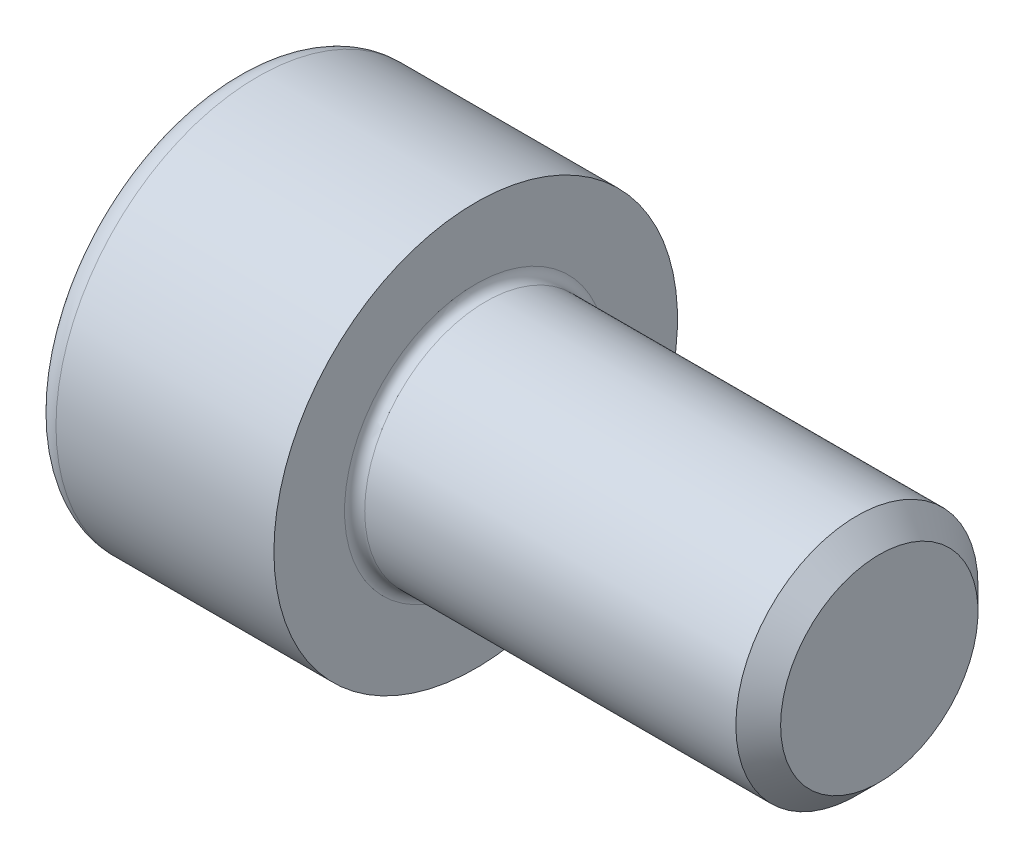
ISO-10303-21;
HEADER;
FILE_DESCRIPTION(('STEP AP214'),'2;1');
FILE_NAME('part.step','',(''),(''),'','','');
FILE_SCHEMA(('AUTOMOTIVE_DESIGN { 1 0 10303 214 1 1 1 1 }'));
ENDSEC;
DATA;
#1=APPLICATION_CONTEXT('core data for automotive mechanical design processes');
#2=APPLICATION_PROTOCOL_DEFINITION('international standard','automotive_design',2000,#1);
#3=PRODUCT_CONTEXT('',#1,'mechanical');
#4=PRODUCT('Part','Part','',(#3));
#5=PRODUCT_RELATED_PRODUCT_CATEGORY('part','',(#4));
#6=PRODUCT_DEFINITION_FORMATION('','',#4);
#7=PRODUCT_DEFINITION_CONTEXT('part definition',#1,'design');
#8=PRODUCT_DEFINITION('design','',#6,#7);
#9=PRODUCT_DEFINITION_SHAPE('','',#8);
#10=(LENGTH_UNIT() NAMED_UNIT(*) SI_UNIT(.MILLI.,.METRE.));
#11=(NAMED_UNIT(*) PLANE_ANGLE_UNIT() SI_UNIT($,.RADIAN.));
#12=(NAMED_UNIT(*) SI_UNIT($,.STERADIAN.) SOLID_ANGLE_UNIT());
#13=UNCERTAINTY_MEASURE_WITH_UNIT(LENGTH_MEASURE(1.E-05),#10,'distance_accuracy_value','');
#14=(GEOMETRIC_REPRESENTATION_CONTEXT(3) GLOBAL_UNCERTAINTY_ASSIGNED_CONTEXT((#13)) GLOBAL_UNIT_ASSIGNED_CONTEXT((#10,
#11,#12)) REPRESENTATION_CONTEXT('',''));
#15=CARTESIAN_POINT('',(0.,0.,0.));
#16=DIRECTION('',(0.,0.,1.));
#17=DIRECTION('',(1.,0.,0.));
#18=AXIS2_PLACEMENT_3D('',#15,#16,#17);
#19=CARTESIAN_POINT('',(0.,0.,0.));
#20=DIRECTION('',(-1.,0.,0.));
#21=DIRECTION('',(0.,0.,1.));
#22=AXIS2_PLACEMENT_3D('',#19,#20,#21);
#23=PLANE('',#22);
#24=DIRECTION('',(0.,-0.499999999999999,0.866025403784439));
#25=VECTOR('',#24,1.);
#26=CARTESIAN_POINT('',(0.,2.89829835133192,0.));
#27=LINE('',#26,#25);
#28=CARTESIAN_POINT('',(0.,2.89829835133192,0.));
#29=VERTEX_POINT('',#28);
#30=CARTESIAN_POINT('',(0.,1.44914917566596,2.51));
#31=VERTEX_POINT('',#30);
#32=EDGE_CURVE('E376',#29,#31,#27,.T.);
#33=ORIENTED_EDGE('',*,*,#32,.T.);
#34=DIRECTION('',(0.,1.,0.));
#35=VECTOR('',#34,1.);
#36=CARTESIAN_POINT('',(0.,-1.44914917566596,2.51));
#37=LINE('',#36,#35);
#38=CARTESIAN_POINT('',(0.,-1.44914917566596,2.51));
#39=VERTEX_POINT('',#38);
#40=EDGE_CURVE('E133',#39,#31,#37,.T.);
#41=ORIENTED_EDGE('',*,*,#40,.F.);
#42=DIRECTION('',(0.,-0.500000000000001,-0.866025403784438));
#43=VECTOR('',#42,1.);
#44=CARTESIAN_POINT('',(0.,-1.44914917566596,2.51));
#45=LINE('',#44,#43);
#46=CARTESIAN_POINT('',(0.,-2.89829835133193,0.));
#47=VERTEX_POINT('',#46);
#48=EDGE_CURVE('E379',#39,#47,#45,.T.);
#49=ORIENTED_EDGE('',*,*,#48,.T.);
#50=DIRECTION('',(0.,0.499999999999999,-0.866025403784439));
#51=VECTOR('',#50,1.);
#52=CARTESIAN_POINT('',(0.,-2.89829835133193,0.));
#53=LINE('',#52,#51);
#54=CARTESIAN_POINT('',(0.,-1.44914917566597,-2.51));
#55=VERTEX_POINT('',#54);
#56=EDGE_CURVE('E382',#47,#55,#53,.T.);
#57=ORIENTED_EDGE('',*,*,#56,.T.);
#58=DIRECTION('',(0.,-1.,0.));
#59=VECTOR('',#58,1.);
#60=CARTESIAN_POINT('',(0.,1.44914917566595,-2.51));
#61=LINE('',#60,#59);
#62=CARTESIAN_POINT('',(0.,1.44914917566595,-2.51));
#63=VERTEX_POINT('',#62);
#64=EDGE_CURVE('E385',#63,#55,#61,.T.);
#65=ORIENTED_EDGE('',*,*,#64,.F.);
#66=DIRECTION('',(0.,-0.500000000000001,-0.866025403784438));
#67=VECTOR('',#66,1.);
#68=CARTESIAN_POINT('',(0.,2.89829835133192,0.));
#69=LINE('',#68,#67);
#70=EDGE_CURVE('E128',#29,#63,#69,.T.);
#71=ORIENTED_EDGE('',*,*,#70,.F.);
#72=EDGE_LOOP('',(#33,#41,#49,#57,#65,#71));
#73=FACE_BOUND('',#72,.T.);
#74=CARTESIAN_POINT('',(0.,0.,0.));
#75=DIRECTION('',(-1.,0.,0.));
#76=DIRECTION('',(0.,0.,1.));
#77=AXIS2_PLACEMENT_3D('',#74,#75,#76);
#78=CIRCLE('',#77,4.4);
#79=CARTESIAN_POINT('',(0.,0.,4.4));
#80=VERTEX_POINT('',#79);
#81=EDGE_CURVE('E45',#80,#80,#78,.T.);
#82=ORIENTED_EDGE('',*,*,#81,.T.);
#83=EDGE_LOOP('',(#82));
#84=FACE_BOUND('',#83,.T.);
#85=ADVANCED_FACE('F37',(#73,#84),#23,.T.);
#86=CARTESIAN_POINT('',(16.,2.4455,0.));
#87=DIRECTION('',(1.,0.,0.));
#88=DIRECTION('',(0.,0.,-1.));
#89=AXIS2_PLACEMENT_3D('',#86,#87,#88);
#90=PLANE('',#89);
#91=CARTESIAN_POINT('',(16.,0.,0.));
#92=DIRECTION('',(-1.,0.,0.));
#93=DIRECTION('',(0.,0.,1.));
#94=AXIS2_PLACEMENT_3D('',#91,#92,#93);
#95=CIRCLE('',#94,2.4455);
#96=CARTESIAN_POINT('',(16.,0.,2.4455));
#97=VERTEX_POINT('',#96);
#98=EDGE_CURVE('E151',#97,#97,#95,.T.);
#99=ORIENTED_EDGE('',*,*,#98,.F.);
#100=EDGE_LOOP('',(#99));
#101=FACE_BOUND('',#100,.T.);
#102=ADVANCED_FACE('F175',(#101),#90,.T.);
#103=CARTESIAN_POINT('',(16.,0.,0.));
#104=DIRECTION('',(-1.,0.,0.));
#105=DIRECTION('',(0.,0.,1.));
#106=AXIS2_PLACEMENT_3D('',#103,#104,#105);
#107=CONICAL_SURFACE('',#106,2.4455,0.785398163397454);
#108=CARTESIAN_POINT('',(15.4455,0.,0.));
#109=DIRECTION('',(-1.,0.,0.));
#110=DIRECTION('',(0.,0.,1.));
#111=AXIS2_PLACEMENT_3D('',#108,#109,#110);
#112=CIRCLE('',#111,3.);
#113=CARTESIAN_POINT('',(15.4455,0.,3.));
#114=VERTEX_POINT('',#113);
#115=EDGE_CURVE('E148',#114,#114,#112,.T.);
#116=ORIENTED_EDGE('',*,*,#115,.F.);
#117=EDGE_LOOP('',(#116));
#118=FACE_BOUND('',#117,.T.);
#119=ORIENTED_EDGE('',*,*,#98,.T.);
#120=EDGE_LOOP('',(#119));
#121=FACE_BOUND('',#120,.T.);
#122=ADVANCED_FACE('F181',(#118,#121),#107,.T.);
#123=CARTESIAN_POINT('',(-31.75,0.,0.));
#124=DIRECTION('',(-1.,0.,0.));
#125=DIRECTION('',(0.,0.,1.));
#126=AXIS2_PLACEMENT_3D('',#123,#124,#125);
#127=CYLINDRICAL_SURFACE('',#126,3.);
#128=CARTESIAN_POINT('',(6.25,0.,0.));
#129=DIRECTION('',(1.,0.,0.));
#130=DIRECTION('',(0.,0.,-1.));
#131=AXIS2_PLACEMENT_3D('',#128,#129,#130);
#132=CIRCLE('',#131,3.);
#133=CARTESIAN_POINT('',(6.25,0.,-3.));
#134=VERTEX_POINT('',#133);
#135=EDGE_CURVE('E157',#134,#134,#132,.T.);
#136=ORIENTED_EDGE('',*,*,#135,.T.);
#137=EDGE_LOOP('',(#136));
#138=FACE_BOUND('',#137,.T.);
#139=ORIENTED_EDGE('',*,*,#115,.T.);
#140=EDGE_LOOP('',(#139));
#141=FACE_BOUND('',#140,.T.);
#142=ADVANCED_FACE('F193',(#138,#141),#127,.T.);
#143=CARTESIAN_POINT('',(6.,5.,0.));
#144=DIRECTION('',(1.,0.,0.));
#145=DIRECTION('',(0.,0.,-1.));
#146=AXIS2_PLACEMENT_3D('',#143,#144,#145);
#147=PLANE('',#146);
#148=CARTESIAN_POINT('',(6.,0.,0.));
#149=DIRECTION('',(1.,0.,0.));
#150=DIRECTION('',(0.,0.,-1.));
#151=AXIS2_PLACEMENT_3D('',#148,#149,#150);
#152=CIRCLE('',#151,3.25);
#153=CARTESIAN_POINT('',(6.,0.,-3.25));
#154=VERTEX_POINT('',#153);
#155=EDGE_CURVE('E154',#154,#154,#152,.F.);
#156=ORIENTED_EDGE('',*,*,#155,.T.);
#157=EDGE_LOOP('',(#156));
#158=FACE_BOUND('',#157,.T.);
#159=CARTESIAN_POINT('',(6.,0.,0.));
#160=DIRECTION('',(-1.,0.,0.));
#161=DIRECTION('',(0.,0.,1.));
#162=AXIS2_PLACEMENT_3D('',#159,#160,#161);
#163=CIRCLE('',#162,5.);
#164=CARTESIAN_POINT('',(6.,0.,5.));
#165=VERTEX_POINT('',#164);
#166=EDGE_CURVE('E144',#165,#165,#163,.T.);
#167=ORIENTED_EDGE('',*,*,#166,.F.);
#168=EDGE_LOOP('',(#167));
#169=FACE_BOUND('',#168,.T.);
#170=ADVANCED_FACE('F189',(#158,#169),#147,.T.);
#171=CARTESIAN_POINT('',(-31.75,0.,0.));
#172=DIRECTION('',(-1.,0.,0.));
#173=DIRECTION('',(0.,0.,1.));
#174=AXIS2_PLACEMENT_3D('',#171,#172,#173);
#175=CYLINDRICAL_SURFACE('',#174,5.);
#176=CARTESIAN_POINT('',(0.600000000000003,0.,0.));
#177=DIRECTION('',(-1.,0.,0.));
#178=DIRECTION('',(0.,0.,1.));
#179=AXIS2_PLACEMENT_3D('',#176,#177,#178);
#180=CIRCLE('',#179,5.);
#181=CARTESIAN_POINT('',(0.600000000000003,0.,5.));
#182=VERTEX_POINT('',#181);
#183=EDGE_CURVE('E11',#182,#182,#180,.F.);
#184=ORIENTED_EDGE('',*,*,#183,.T.);
#185=EDGE_LOOP('',(#184));
#186=FACE_BOUND('',#185,.T.);
#187=ORIENTED_EDGE('',*,*,#166,.T.);
#188=EDGE_LOOP('',(#187));
#189=FACE_BOUND('',#188,.T.);
#190=ADVANCED_FACE('F171',(#186,#189),#175,.T.);
#191=CARTESIAN_POINT('',(6.25,0.,0.));
#192=DIRECTION('',(1.,0.,0.));
#193=DIRECTION('',(0.,0.,-1.));
#194=AXIS2_PLACEMENT_3D('',#191,#192,#193);
#195=TOROIDAL_SURFACE('',#194,3.25,0.25);
#196=ORIENTED_EDGE('',*,*,#135,.F.);
#197=EDGE_LOOP('',(#196));
#198=FACE_BOUND('',#197,.T.);
#199=ORIENTED_EDGE('',*,*,#155,.F.);
#200=EDGE_LOOP('',(#199));
#201=FACE_BOUND('',#200,.T.);
#202=ADVANCED_FACE('F164',(#198,#201),#195,.F.);
#203=CARTESIAN_POINT('',(0.600000000000003,0.,0.));
#204=DIRECTION('',(-1.,0.,0.));
#205=DIRECTION('',(0.,0.,1.));
#206=AXIS2_PLACEMENT_3D('',#203,#204,#205);
#207=TOROIDAL_SURFACE('',#206,4.4,0.6);
#208=ORIENTED_EDGE('',*,*,#183,.F.);
#209=EDGE_LOOP('',(#208));
#210=FACE_BOUND('',#209,.T.);
#211=ORIENTED_EDGE('',*,*,#81,.F.);
#212=EDGE_LOOP('',(#211));
#213=FACE_BOUND('',#212,.T.);
#214=ADVANCED_FACE('F39',(#210,#213),#207,.T.);
#215=CARTESIAN_POINT('',(3.,2.89829835133192,0.));
#216=DIRECTION('',(0.,-0.866025403784439,-0.499999999999999));
#217=DIRECTION('',(0.,0.499999999999999,-0.866025403784439));
#218=AXIS2_PLACEMENT_3D('',#215,#216,#217);
#219=PLANE('',#218);
#220=ORIENTED_EDGE('',*,*,#32,.F.);
#221=DIRECTION('',(-1.,0.,0.));
#222=VECTOR('',#221,1.);
#223=CARTESIAN_POINT('',(3.,2.89829835133192,0.));
#224=LINE('',#223,#222);
#225=CARTESIAN_POINT('',(3.,2.89829835133192,0.));
#226=VERTEX_POINT('',#225);
#227=EDGE_CURVE('E366',#226,#29,#224,.T.);
#228=ORIENTED_EDGE('',*,*,#227,.F.);
#229=DIRECTION('',(0.,-0.499999999999999,0.866025403784439));
#230=VECTOR('',#229,1.);
#231=CARTESIAN_POINT('',(3.,2.89829835133192,0.));
#232=LINE('',#231,#230);
#233=CARTESIAN_POINT('',(3.,2.17372376349894,1.255));
#234=VERTEX_POINT('',#233);
#235=EDGE_CURVE('E120',#226,#234,#232,.T.);
#236=ORIENTED_EDGE('',*,*,#235,.T.);
#237=CARTESIAN_POINT('',(3.,1.44914917566596,2.51));
#238=VERTEX_POINT('',#237);
#239=EDGE_CURVE('E111',#234,#238,#232,.T.);
#240=ORIENTED_EDGE('',*,*,#239,.T.);
#241=DIRECTION('',(-1.,0.,0.));
#242=VECTOR('',#241,1.);
#243=CARTESIAN_POINT('',(3.,1.44914917566596,2.51));
#244=LINE('',#243,#242);
#245=EDGE_CURVE('E125',#238,#31,#244,.T.);
#246=ORIENTED_EDGE('',*,*,#245,.T.);
#247=EDGE_LOOP('',(#220,#228,#236,#240,#246));
#248=FACE_BOUND('',#247,.T.);
#249=ADVANCED_FACE('F124',(#248),#219,.T.);
#250=CARTESIAN_POINT('',(3.,-1.44914917566596,2.51));
#251=DIRECTION('',(0.,0.,1.));
#252=DIRECTION('',(0.,-1.,0.));
#253=AXIS2_PLACEMENT_3D('',#250,#251,#252);
#254=PLANE('',#253);
#255=ORIENTED_EDGE('',*,*,#40,.T.);
#256=ORIENTED_EDGE('',*,*,#245,.F.);
#257=DIRECTION('',(0.,1.,0.));
#258=VECTOR('',#257,1.);
#259=CARTESIAN_POINT('',(3.,-1.44914917566596,2.51));
#260=LINE('',#259,#258);
#261=CARTESIAN_POINT('',(3.,0.,2.51));
#262=VERTEX_POINT('',#261);
#263=EDGE_CURVE('E108',#262,#238,#260,.T.);
#264=ORIENTED_EDGE('',*,*,#263,.F.);
#265=CARTESIAN_POINT('',(3.,-1.44914917566596,2.51));
#266=VERTEX_POINT('',#265);
#267=EDGE_CURVE('E119',#266,#262,#260,.T.);
#268=ORIENTED_EDGE('',*,*,#267,.F.);
#269=DIRECTION('',(-1.,0.,0.));
#270=VECTOR('',#269,1.);
#271=CARTESIAN_POINT('',(3.,-1.44914917566596,2.51));
#272=LINE('',#271,#270);
#273=EDGE_CURVE('E135',#266,#39,#272,.T.);
#274=ORIENTED_EDGE('',*,*,#273,.T.);
#275=EDGE_LOOP('',(#255,#256,#264,#268,#274));
#276=FACE_BOUND('',#275,.T.);
#277=ADVANCED_FACE('F130',(#276),#254,.F.);
#278=CARTESIAN_POINT('',(3.,-1.44914917566596,2.51));
#279=DIRECTION('',(0.,0.866025403784438,-0.500000000000001));
#280=DIRECTION('',(0.,0.500000000000001,0.866025403784438));
#281=AXIS2_PLACEMENT_3D('',#278,#279,#280);
#282=PLANE('',#281);
#283=ORIENTED_EDGE('',*,*,#48,.F.);
#284=ORIENTED_EDGE('',*,*,#273,.F.);
#285=DIRECTION('',(0.,-0.500000000000001,-0.866025403784438));
#286=VECTOR('',#285,1.);
#287=CARTESIAN_POINT('',(3.,-1.44914917566596,2.51));
#288=LINE('',#287,#286);
#289=CARTESIAN_POINT('',(3.,-2.17372376349894,1.25500000000001));
#290=VERTEX_POINT('',#289);
#291=EDGE_CURVE('E405',#266,#290,#288,.T.);
#292=ORIENTED_EDGE('',*,*,#291,.T.);
#293=CARTESIAN_POINT('',(3.,-2.89829835133193,0.));
#294=VERTEX_POINT('',#293);
#295=EDGE_CURVE('E394',#290,#294,#288,.T.);
#296=ORIENTED_EDGE('',*,*,#295,.T.);
#297=DIRECTION('',(-1.,0.,0.));
#298=VECTOR('',#297,1.);
#299=CARTESIAN_POINT('',(3.,-2.89829835133193,0.));
#300=LINE('',#299,#298);
#301=EDGE_CURVE('E140',#294,#47,#300,.T.);
#302=ORIENTED_EDGE('',*,*,#301,.T.);
#303=EDGE_LOOP('',(#283,#284,#292,#296,#302));
#304=FACE_BOUND('',#303,.T.);
#305=ADVANCED_FACE('F257',(#304),#282,.T.);
#306=CARTESIAN_POINT('',(3.,-2.89829835133193,0.));
#307=DIRECTION('',(0.,0.866025403784439,0.499999999999999));
#308=DIRECTION('',(0.,-0.499999999999999,0.866025403784439));
#309=AXIS2_PLACEMENT_3D('',#306,#307,#308);
#310=PLANE('',#309);
#311=ORIENTED_EDGE('',*,*,#56,.F.);
#312=ORIENTED_EDGE('',*,*,#301,.F.);
#313=DIRECTION('',(0.,0.499999999999999,-0.866025403784439));
#314=VECTOR('',#313,1.);
#315=CARTESIAN_POINT('',(3.,-2.89829835133193,0.));
#316=LINE('',#315,#314);
#317=CARTESIAN_POINT('',(3.,-2.17372376349895,-1.255));
#318=VERTEX_POINT('',#317);
#319=EDGE_CURVE('E372',#294,#318,#316,.T.);
#320=ORIENTED_EDGE('',*,*,#319,.T.);
#321=CARTESIAN_POINT('',(3.,-1.44914917566597,-2.51));
#322=VERTEX_POINT('',#321);
#323=EDGE_CURVE('E404',#318,#322,#316,.T.);
#324=ORIENTED_EDGE('',*,*,#323,.T.);
#325=DIRECTION('',(-1.,0.,0.));
#326=VECTOR('',#325,1.);
#327=CARTESIAN_POINT('',(3.,-1.44914917566597,-2.51));
#328=LINE('',#327,#326);
#329=EDGE_CURVE('E365',#322,#55,#328,.T.);
#330=ORIENTED_EDGE('',*,*,#329,.T.);
#331=EDGE_LOOP('',(#311,#312,#320,#324,#330));
#332=FACE_BOUND('',#331,.T.);
#333=ADVANCED_FACE('F265',(#332),#310,.T.);
#334=CARTESIAN_POINT('',(3.,1.44914917566595,-2.51));
#335=DIRECTION('',(0.,0.,-1.));
#336=DIRECTION('',(0.,1.,0.));
#337=AXIS2_PLACEMENT_3D('',#334,#335,#336);
#338=PLANE('',#337);
#339=ORIENTED_EDGE('',*,*,#64,.T.);
#340=ORIENTED_EDGE('',*,*,#329,.F.);
#341=DIRECTION('',(0.,-1.,0.));
#342=VECTOR('',#341,1.);
#343=CARTESIAN_POINT('',(3.,1.44914917566595,-2.51));
#344=LINE('',#343,#342);
#345=CARTESIAN_POINT('',(3.,0.,-2.51));
#346=VERTEX_POINT('',#345);
#347=EDGE_CURVE('E369',#346,#322,#344,.T.);
#348=ORIENTED_EDGE('',*,*,#347,.F.);
#349=CARTESIAN_POINT('',(3.,1.44914917566595,-2.51));
#350=VERTEX_POINT('',#349);
#351=EDGE_CURVE('E52',#350,#346,#344,.T.);
#352=ORIENTED_EDGE('',*,*,#351,.F.);
#353=DIRECTION('',(-1.,0.,0.));
#354=VECTOR('',#353,1.);
#355=CARTESIAN_POINT('',(3.,1.44914917566595,-2.51));
#356=LINE('',#355,#354);
#357=EDGE_CURVE('E362',#350,#63,#356,.T.);
#358=ORIENTED_EDGE('',*,*,#357,.T.);
#359=EDGE_LOOP('',(#339,#340,#348,#352,#358));
#360=FACE_BOUND('',#359,.T.);
#361=ADVANCED_FACE('F274',(#360),#338,.F.);
#362=CARTESIAN_POINT('',(3.,2.89829835133192,0.));
#363=DIRECTION('',(0.,0.866025403784438,-0.500000000000001));
#364=DIRECTION('',(0.,0.500000000000001,0.866025403784438));
#365=AXIS2_PLACEMENT_3D('',#362,#363,#364);
#366=PLANE('',#365);
#367=ORIENTED_EDGE('',*,*,#70,.T.);
#368=ORIENTED_EDGE('',*,*,#357,.F.);
#369=DIRECTION('',(0.,-0.500000000000001,-0.866025403784438));
#370=VECTOR('',#369,1.);
#371=CARTESIAN_POINT('',(3.,2.89829835133192,0.));
#372=LINE('',#371,#370);
#373=CARTESIAN_POINT('',(3.,2.17372376349894,-1.255));
#374=VERTEX_POINT('',#373);
#375=EDGE_CURVE('E352',#374,#350,#372,.T.);
#376=ORIENTED_EDGE('',*,*,#375,.F.);
#377=EDGE_CURVE('E358',#226,#374,#372,.T.);
#378=ORIENTED_EDGE('',*,*,#377,.F.);
#379=ORIENTED_EDGE('',*,*,#227,.T.);
#380=EDGE_LOOP('',(#367,#368,#376,#378,#379));
#381=FACE_BOUND('',#380,.T.);
#382=ADVANCED_FACE('F283',(#381),#366,.F.);
#383=CARTESIAN_POINT('',(3.,2.89829835133192,0.));
#384=DIRECTION('',(1.,0.,0.));
#385=DIRECTION('',(0.,0.,-1.));
#386=AXIS2_PLACEMENT_3D('',#383,#384,#385);
#387=PLANE('',#386);
#388=ORIENTED_EDGE('',*,*,#347,.T.);
#389=ORIENTED_EDGE('',*,*,#323,.F.);
#390=CARTESIAN_POINT('',(3.,0.,0.));
#391=DIRECTION('',(-1.,0.,0.));
#392=DIRECTION('',(0.,0.,1.));
#393=AXIS2_PLACEMENT_3D('',#390,#391,#392);
#394=CIRCLE('',#393,2.51);
#395=EDGE_CURVE('E400',#346,#318,#394,.T.);
#396=ORIENTED_EDGE('',*,*,#395,.F.);
#397=EDGE_LOOP('',(#388,#389,#396));
#398=FACE_BOUND('',#397,.T.);
#399=ADVANCED_FACE('F292',(#398),#387,.F.);
#400=ORIENTED_EDGE('',*,*,#319,.F.);
#401=ORIENTED_EDGE('',*,*,#295,.F.);
#402=EDGE_CURVE('E138',#318,#290,#394,.T.);
#403=ORIENTED_EDGE('',*,*,#402,.F.);
#404=EDGE_LOOP('',(#400,#401,#403));
#405=FACE_BOUND('',#404,.T.);
#406=ADVANCED_FACE('F301',(#405),#387,.F.);
#407=ORIENTED_EDGE('',*,*,#291,.F.);
#408=ORIENTED_EDGE('',*,*,#267,.T.);
#409=EDGE_CURVE('E134',#290,#262,#394,.T.);
#410=ORIENTED_EDGE('',*,*,#409,.F.);
#411=EDGE_LOOP('',(#407,#408,#410));
#412=FACE_BOUND('',#411,.T.);
#413=ADVANCED_FACE('F310',(#412),#387,.F.);
#414=ORIENTED_EDGE('',*,*,#263,.T.);
#415=ORIENTED_EDGE('',*,*,#239,.F.);
#416=EDGE_CURVE('E114',#262,#234,#394,.T.);
#417=ORIENTED_EDGE('',*,*,#416,.F.);
#418=EDGE_LOOP('',(#414,#415,#417));
#419=FACE_BOUND('',#418,.T.);
#420=ADVANCED_FACE('F110',(#419),#387,.F.);
#421=ORIENTED_EDGE('',*,*,#235,.F.);
#422=ORIENTED_EDGE('',*,*,#377,.T.);
#423=EDGE_CURVE('E145',#234,#374,#394,.T.);
#424=ORIENTED_EDGE('',*,*,#423,.F.);
#425=EDGE_LOOP('',(#421,#422,#424));
#426=FACE_BOUND('',#425,.T.);
#427=ADVANCED_FACE('F325',(#426),#387,.F.);
#428=ORIENTED_EDGE('',*,*,#375,.T.);
#429=ORIENTED_EDGE('',*,*,#351,.T.);
#430=EDGE_CURVE('E355',#374,#346,#394,.T.);
#431=ORIENTED_EDGE('',*,*,#430,.F.);
#432=EDGE_LOOP('',(#428,#429,#431));
#433=FACE_BOUND('',#432,.T.);
#434=ADVANCED_FACE('F240',(#433),#387,.F.);
#435=CARTESIAN_POINT('',(3.,0.,0.));
#436=DIRECTION('',(-1.,0.,0.));
#437=DIRECTION('',(0.,0.,1.));
#438=AXIS2_PLACEMENT_3D('',#435,#436,#437);
#439=CONICAL_SURFACE('',#438,2.51,1.04719755119659);
#440=CARTESIAN_POINT('',(4.44914917566598,0.,0.));
#441=VERTEX_POINT('',#440);
#442=VERTEX_LOOP('',#441);
#443=FACE_BOUND('',#442,.T.);
#444=ORIENTED_EDGE('',*,*,#416,.T.);
#445=ORIENTED_EDGE('',*,*,#423,.T.);
#446=ORIENTED_EDGE('',*,*,#430,.T.);
#447=ORIENTED_EDGE('',*,*,#395,.T.);
#448=ORIENTED_EDGE('',*,*,#402,.T.);
#449=ORIENTED_EDGE('',*,*,#409,.T.);
#450=EDGE_LOOP('',(#444,#445,#446,#447,#448,#449));
#451=FACE_BOUND('',#450,.T.);
#452=ADVANCED_FACE('F186',(#443,#451),#439,.F.);
#453=CLOSED_SHELL('',(#85,#102,#122,#142,#170,#190,#202,#214,#249,#277,#305,#333,#361,#382,#399,
#406,#413,#420,#427,#434,#452));
#454=MANIFOLD_SOLID_BREP('B2',#453);
#455=ADVANCED_BREP_SHAPE_REPRESENTATION('',(#18,#454),#14);
#456=SHAPE_DEFINITION_REPRESENTATION(#9,#455);
ENDSEC;
END-ISO-10303-21;
